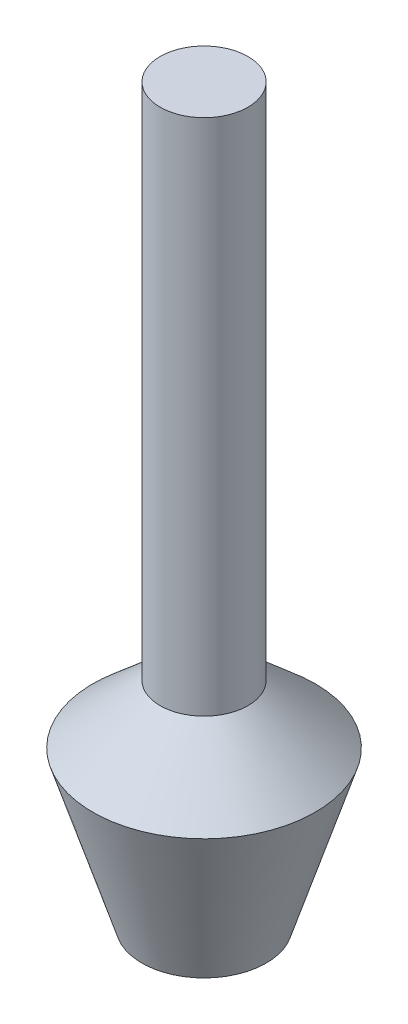
ISO-10303-21;
HEADER;
FILE_DESCRIPTION(('STEP AP214'),'2;1');
FILE_NAME('part.step','',(''),(''),'','','');
FILE_SCHEMA(('AUTOMOTIVE_DESIGN { 1 0 10303 214 1 1 1 1 }'));
ENDSEC;
DATA;
#1=APPLICATION_CONTEXT('core data for automotive mechanical design processes');
#2=APPLICATION_PROTOCOL_DEFINITION('international standard','automotive_design',2000,#1);
#3=PRODUCT_CONTEXT('',#1,'mechanical');
#4=PRODUCT('Part','Part','',(#3));
#5=PRODUCT_RELATED_PRODUCT_CATEGORY('part','',(#4));
#6=PRODUCT_DEFINITION_FORMATION('','',#4);
#7=PRODUCT_DEFINITION_CONTEXT('part definition',#1,'design');
#8=PRODUCT_DEFINITION('design','',#6,#7);
#9=PRODUCT_DEFINITION_SHAPE('','',#8);
#10=(LENGTH_UNIT() NAMED_UNIT(*) SI_UNIT(.MILLI.,.METRE.));
#11=(NAMED_UNIT(*) PLANE_ANGLE_UNIT() SI_UNIT($,.RADIAN.));
#12=(NAMED_UNIT(*) SI_UNIT($,.STERADIAN.) SOLID_ANGLE_UNIT());
#13=UNCERTAINTY_MEASURE_WITH_UNIT(LENGTH_MEASURE(1.E-05),#10,'distance_accuracy_value','');
#14=(GEOMETRIC_REPRESENTATION_CONTEXT(3) GLOBAL_UNCERTAINTY_ASSIGNED_CONTEXT((#13)) GLOBAL_UNIT_ASSIGNED_CONTEXT((#10,
#11,#12)) REPRESENTATION_CONTEXT('',''));
#15=CARTESIAN_POINT('',(0.,0.,0.));
#16=DIRECTION('',(0.,0.,1.));
#17=DIRECTION('',(1.,0.,0.));
#18=AXIS2_PLACEMENT_3D('',#15,#16,#17);
#19=CARTESIAN_POINT('',(0.,13.462,0.));
#20=DIRECTION('',(0.,-1.,0.));
#21=DIRECTION('',(0.,0.,-1.));
#22=AXIS2_PLACEMENT_3D('',#19,#20,#21);
#23=CONICAL_SURFACE('',#22,9.652,0.855052737125842);
#24=CARTESIAN_POINT('',(0.,18.5420000000018,0.));
#25=DIRECTION('',(0.,-1.,0.));
#26=DIRECTION('',(0.,0.,-1.));
#27=AXIS2_PLACEMENT_3D('',#24,#25,#26);
#28=CIRCLE('',#27,3.81000000000001);
#29=CARTESIAN_POINT('',(0.,18.5420000000018,-3.81000000000001));
#30=VERTEX_POINT('',#29);
#31=EDGE_CURVE('E10',#30,#30,#28,.T.);
#32=ORIENTED_EDGE('',*,*,#31,.T.);
#33=EDGE_LOOP('',(#32));
#34=FACE_BOUND('',#33,.T.);
#35=CARTESIAN_POINT('',(0.,13.462,0.));
#36=DIRECTION('',(0.,-1.,0.));
#37=DIRECTION('',(0.,0.,-1.));
#38=AXIS2_PLACEMENT_3D('',#35,#36,#37);
#39=CIRCLE('',#38,9.652);
#40=CARTESIAN_POINT('',(0.,13.462,-9.652));
#41=VERTEX_POINT('',#40);
#42=EDGE_CURVE('E64',#41,#41,#39,.T.);
#43=ORIENTED_EDGE('',*,*,#42,.F.);
#44=EDGE_LOOP('',(#43));
#45=FACE_BOUND('',#44,.T.);
#46=ADVANCED_FACE('F45',(#34,#45),#23,.T.);
#47=CARTESIAN_POINT('',(0.,0.,0.));
#48=DIRECTION('',(0.,-1.,0.));
#49=DIRECTION('',(0.,0.,-1.));
#50=AXIS2_PLACEMENT_3D('',#47,#48,#49);
#51=CYLINDRICAL_SURFACE('',#50,3.81000000000001);
#52=ORIENTED_EDGE('',*,*,#31,.F.);
#53=EDGE_LOOP('',(#52));
#54=FACE_BOUND('',#53,.T.);
#55=CARTESIAN_POINT('',(0.,63.5,0.));
#56=DIRECTION('',(0.,-1.,0.));
#57=DIRECTION('',(0.,0.,-1.));
#58=AXIS2_PLACEMENT_3D('',#55,#56,#57);
#59=CIRCLE('',#58,3.81000000000001);
#60=CARTESIAN_POINT('',(0.,63.5,-3.81000000000001));
#61=VERTEX_POINT('',#60);
#62=EDGE_CURVE('E52',#61,#61,#59,.T.);
#63=ORIENTED_EDGE('',*,*,#62,.T.);
#64=EDGE_LOOP('',(#63));
#65=FACE_BOUND('',#64,.T.);
#66=ADVANCED_FACE('F75',(#54,#65),#51,.T.);
#67=CARTESIAN_POINT('',(0.,63.5,0.));
#68=DIRECTION('',(0.,-1.,0.));
#69=DIRECTION('',(0.,0.,-1.));
#70=AXIS2_PLACEMENT_3D('',#67,#68,#69);
#71=PLANE('',#70);
#72=ORIENTED_EDGE('',*,*,#62,.F.);
#73=EDGE_LOOP('',(#72));
#74=FACE_BOUND('',#73,.T.);
#75=ADVANCED_FACE('F79',(#74),#71,.F.);
#76=CARTESIAN_POINT('',(0.,0.,0.));
#77=DIRECTION('',(0.,-1.,0.));
#78=DIRECTION('',(0.,0.,-1.));
#79=AXIS2_PLACEMENT_3D('',#76,#77,#78);
#80=PLANE('',#79);
#81=CARTESIAN_POINT('',(0.,0.,0.));
#82=DIRECTION('',(0.,-1.,0.));
#83=DIRECTION('',(0.,0.,-1.));
#84=AXIS2_PLACEMENT_3D('',#81,#82,#83);
#85=CIRCLE('',#84,5.3975);
#86=CARTESIAN_POINT('',(0.,0.,-5.3975));
#87=VERTEX_POINT('',#86);
#88=EDGE_CURVE('E58',#87,#87,#85,.T.);
#89=ORIENTED_EDGE('',*,*,#88,.T.);
#90=EDGE_LOOP('',(#89));
#91=FACE_BOUND('',#90,.T.);
#92=ADVANCED_FACE('F84',(#91),#80,.T.);
#93=CARTESIAN_POINT('',(0.,13.462,0.));
#94=DIRECTION('',(0.,1.,0.));
#95=DIRECTION('',(0.,0.,1.));
#96=AXIS2_PLACEMENT_3D('',#93,#94,#95);
#97=CONICAL_SURFACE('',#96,9.652,0.306104605035329);
#98=ORIENTED_EDGE('',*,*,#88,.F.);
#99=EDGE_LOOP('',(#98));
#100=FACE_BOUND('',#99,.T.);
#101=ORIENTED_EDGE('',*,*,#42,.T.);
#102=EDGE_LOOP('',(#101));
#103=FACE_BOUND('',#102,.T.);
#104=ADVANCED_FACE('F72',(#100,#103),#97,.T.);
#105=CLOSED_SHELL('',(#46,#66,#75,#92,#104));
#106=MANIFOLD_SOLID_BREP('B2',#105);
#107=ADVANCED_BREP_SHAPE_REPRESENTATION('',(#18,#106),#14);
#108=SHAPE_DEFINITION_REPRESENTATION(#9,#107);
ENDSEC;
END-ISO-10303-21;
